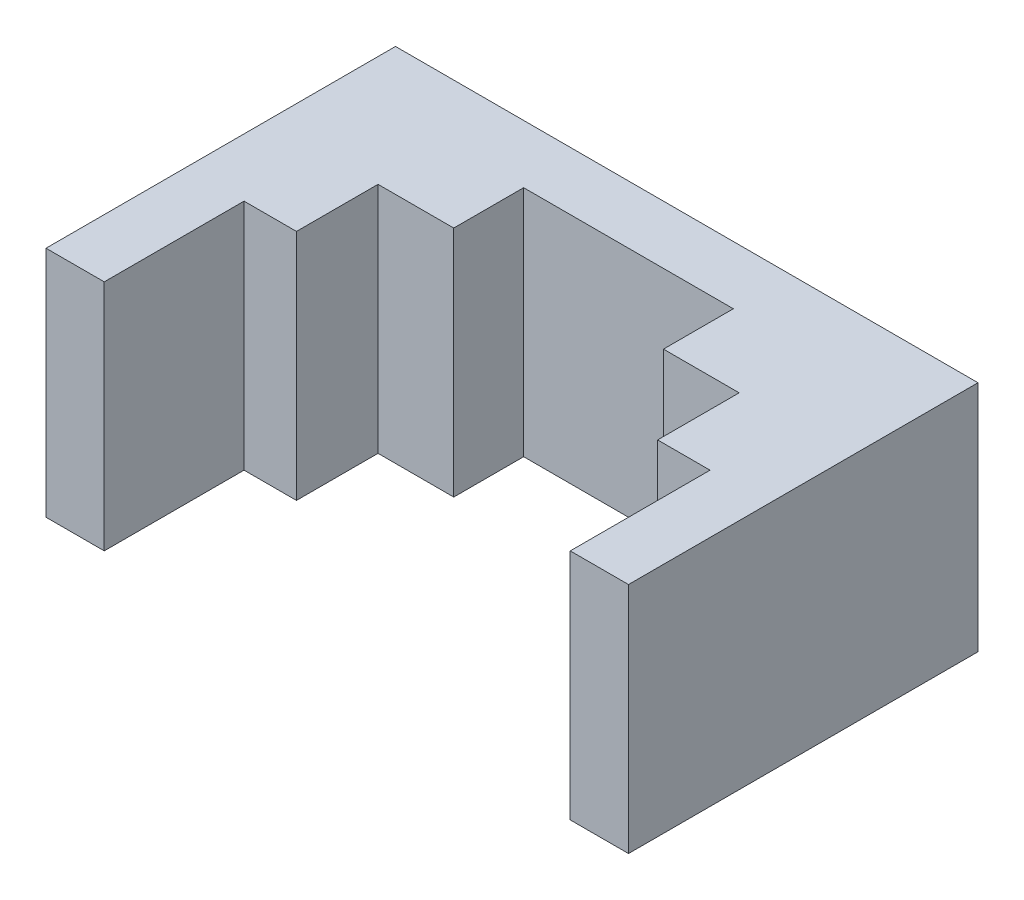
ISO-10303-21;
HEADER;
FILE_DESCRIPTION(('STEP AP214'),'2;1');
FILE_NAME('part.step','',(''),(''),'','','');
FILE_SCHEMA(('AUTOMOTIVE_DESIGN { 1 0 10303 214 1 1 1 1 }'));
ENDSEC;
DATA;
#1=APPLICATION_CONTEXT('core data for automotive mechanical design processes');
#2=APPLICATION_PROTOCOL_DEFINITION('international standard','automotive_design',2000,#1);
#3=PRODUCT_CONTEXT('',#1,'mechanical');
#4=PRODUCT('Part','Part','',(#3));
#5=PRODUCT_RELATED_PRODUCT_CATEGORY('part','',(#4));
#6=PRODUCT_DEFINITION_FORMATION('','',#4);
#7=PRODUCT_DEFINITION_CONTEXT('part definition',#1,'design');
#8=PRODUCT_DEFINITION('design','',#6,#7);
#9=PRODUCT_DEFINITION_SHAPE('','',#8);
#10=(LENGTH_UNIT() NAMED_UNIT(*) SI_UNIT(.MILLI.,.METRE.));
#11=(NAMED_UNIT(*) PLANE_ANGLE_UNIT() SI_UNIT($,.RADIAN.));
#12=(NAMED_UNIT(*) SI_UNIT($,.STERADIAN.) SOLID_ANGLE_UNIT());
#13=UNCERTAINTY_MEASURE_WITH_UNIT(LENGTH_MEASURE(1.E-05),#10,'distance_accuracy_value','');
#14=(GEOMETRIC_REPRESENTATION_CONTEXT(3) GLOBAL_UNCERTAINTY_ASSIGNED_CONTEXT((#13)) GLOBAL_UNIT_ASSIGNED_CONTEXT((#10,
#11,#12)) REPRESENTATION_CONTEXT('',''));
#15=CARTESIAN_POINT('',(0.,0.,0.));
#16=DIRECTION('',(0.,0.,1.));
#17=DIRECTION('',(1.,0.,0.));
#18=AXIS2_PLACEMENT_3D('',#15,#16,#17);
#19=CARTESIAN_POINT('',(4.5,5.,2.5));
#20=DIRECTION('',(1.,0.,0.));
#21=DIRECTION('',(0.,0.,-1.));
#22=AXIS2_PLACEMENT_3D('',#19,#20,#21);
#23=PLANE('',#22);
#24=DIRECTION('',(0.,-1.,0.));
#25=VECTOR('',#24,1.);
#26=CARTESIAN_POINT('',(4.5,5.,5.5));
#27=LINE('',#26,#25);
#28=CARTESIAN_POINT('',(4.5,5.,5.5));
#29=VERTEX_POINT('',#28);
#30=CARTESIAN_POINT('',(4.5,-5.,5.5));
#31=VERTEX_POINT('',#30);
#32=EDGE_CURVE('E177',#29,#31,#27,.T.);
#33=ORIENTED_EDGE('',*,*,#32,.F.);
#34=DIRECTION('',(0.,0.,1.));
#35=VECTOR('',#34,1.);
#36=CARTESIAN_POINT('',(4.5,5.,2.5));
#37=LINE('',#36,#35);
#38=CARTESIAN_POINT('',(4.5,5.,2.5));
#39=VERTEX_POINT('',#38);
#40=EDGE_CURVE('E167',#39,#29,#37,.T.);
#41=ORIENTED_EDGE('',*,*,#40,.F.);
#42=DIRECTION('',(0.,1.,0.));
#43=VECTOR('',#42,1.);
#44=CARTESIAN_POINT('',(4.5,5.,2.5));
#45=LINE('',#44,#43);
#46=CARTESIAN_POINT('',(4.5,-5.,2.5));
#47=VERTEX_POINT('',#46);
#48=EDGE_CURVE('E183',#47,#39,#45,.T.);
#49=ORIENTED_EDGE('',*,*,#48,.F.);
#50=DIRECTION('',(0.,0.,1.));
#51=VECTOR('',#50,1.);
#52=CARTESIAN_POINT('',(4.5,-5.,2.5));
#53=LINE('',#52,#51);
#54=EDGE_CURVE('E195',#47,#31,#53,.T.);
#55=ORIENTED_EDGE('',*,*,#54,.T.);
#56=EDGE_LOOP('',(#33,#41,#49,#55));
#57=FACE_BOUND('',#56,.T.);
#58=ADVANCED_FACE('F33',(#57),#23,.F.);
#59=CARTESIAN_POINT('',(-4.5,5.,2.5));
#60=DIRECTION('',(-1.,0.,0.));
#61=DIRECTION('',(0.,0.,1.));
#62=AXIS2_PLACEMENT_3D('',#59,#60,#61);
#63=PLANE('',#62);
#64=DIRECTION('',(0.,1.,0.));
#65=VECTOR('',#64,1.);
#66=CARTESIAN_POINT('',(-4.5,5.,5.5));
#67=LINE('',#66,#65);
#68=CARTESIAN_POINT('',(-4.5,-5.,5.5));
#69=VERTEX_POINT('',#68);
#70=CARTESIAN_POINT('',(-4.5,5.,5.5));
#71=VERTEX_POINT('',#70);
#72=EDGE_CURVE('E11',#69,#71,#67,.T.);
#73=ORIENTED_EDGE('',*,*,#72,.F.);
#74=DIRECTION('',(0.,0.,1.));
#75=VECTOR('',#74,1.);
#76=CARTESIAN_POINT('',(-4.5,-5.,2.5));
#77=LINE('',#76,#75);
#78=CARTESIAN_POINT('',(-4.5,-5.,2.5));
#79=VERTEX_POINT('',#78);
#80=EDGE_CURVE('E199',#79,#69,#77,.T.);
#81=ORIENTED_EDGE('',*,*,#80,.F.);
#82=DIRECTION('',(0.,-1.,0.));
#83=VECTOR('',#82,1.);
#84=CARTESIAN_POINT('',(-4.5,5.,2.5));
#85=LINE('',#84,#83);
#86=CARTESIAN_POINT('',(-4.5,5.,2.5));
#87=VERTEX_POINT('',#86);
#88=EDGE_CURVE('E189',#87,#79,#85,.T.);
#89=ORIENTED_EDGE('',*,*,#88,.F.);
#90=DIRECTION('',(0.,0.,1.));
#91=VECTOR('',#90,1.);
#92=CARTESIAN_POINT('',(-4.5,5.,2.5));
#93=LINE('',#92,#91);
#94=EDGE_CURVE('E202',#87,#71,#93,.T.);
#95=ORIENTED_EDGE('',*,*,#94,.T.);
#96=EDGE_LOOP('',(#73,#81,#89,#95));
#97=FACE_BOUND('',#96,.T.);
#98=ADVANCED_FACE('F301',(#97),#63,.F.);
#99=CARTESIAN_POINT('',(0.,0.,9.));
#100=DIRECTION('',(0.,0.,1.));
#101=DIRECTION('',(1.,0.,0.));
#102=AXIS2_PLACEMENT_3D('',#99,#100,#101);
#103=PLANE('',#102);
#104=DIRECTION('',(0.,1.,0.));
#105=VECTOR('',#104,1.);
#106=CARTESIAN_POINT('',(7.75,5.,9.));
#107=LINE('',#106,#105);
#108=CARTESIAN_POINT('',(7.75,-5.,9.));
#109=VERTEX_POINT('',#108);
#110=CARTESIAN_POINT('',(7.75,5.,9.));
#111=VERTEX_POINT('',#110);
#112=EDGE_CURVE('E152',#109,#111,#107,.T.);
#113=ORIENTED_EDGE('',*,*,#112,.F.);
#114=DIRECTION('',(1.,0.,0.));
#115=VECTOR('',#114,1.);
#116=CARTESIAN_POINT('',(-10.,-5.,9.));
#117=LINE('',#116,#115);
#118=CARTESIAN_POINT('',(10.,-5.,9.));
#119=VERTEX_POINT('',#118);
#120=EDGE_CURVE('E216',#109,#119,#117,.T.);
#121=ORIENTED_EDGE('',*,*,#120,.T.);
#122=DIRECTION('',(0.,1.,0.));
#123=VECTOR('',#122,1.);
#124=CARTESIAN_POINT('',(10.,5.,9.));
#125=LINE('',#124,#123);
#126=CARTESIAN_POINT('',(10.,5.,9.));
#127=VERTEX_POINT('',#126);
#128=EDGE_CURVE('E206',#119,#127,#125,.T.);
#129=ORIENTED_EDGE('',*,*,#128,.T.);
#130=DIRECTION('',(-1.,0.,0.));
#131=VECTOR('',#130,1.);
#132=CARTESIAN_POINT('',(-10.,5.,9.));
#133=LINE('',#132,#131);
#134=EDGE_CURVE('E211',#127,#111,#133,.T.);
#135=ORIENTED_EDGE('',*,*,#134,.T.);
#136=EDGE_LOOP('',(#113,#121,#129,#135));
#137=FACE_BOUND('',#136,.T.);
#138=ADVANCED_FACE('F310',(#137),#103,.T.);
#139=CARTESIAN_POINT('',(0.,0.,15.));
#140=DIRECTION('',(0.,0.,1.));
#141=DIRECTION('',(1.,0.,0.));
#142=AXIS2_PLACEMENT_3D('',#139,#140,#141);
#143=PLANE('',#142);
#144=DIRECTION('',(0.,1.,0.));
#145=VECTOR('',#144,1.);
#146=CARTESIAN_POINT('',(10.,5.,15.));
#147=LINE('',#146,#145);
#148=CARTESIAN_POINT('',(10.,-5.,15.));
#149=VERTEX_POINT('',#148);
#150=CARTESIAN_POINT('',(10.,5.,15.));
#151=VERTEX_POINT('',#150);
#152=EDGE_CURVE('E198',#149,#151,#147,.T.);
#153=ORIENTED_EDGE('',*,*,#152,.F.);
#154=DIRECTION('',(1.,0.,0.));
#155=VECTOR('',#154,1.);
#156=CARTESIAN_POINT('',(-12.5,-5.,15.));
#157=LINE('',#156,#155);
#158=CARTESIAN_POINT('',(12.5,-5.,15.));
#159=VERTEX_POINT('',#158);
#160=EDGE_CURVE('E243',#149,#159,#157,.T.);
#161=ORIENTED_EDGE('',*,*,#160,.T.);
#162=DIRECTION('',(0.,1.,0.));
#163=VECTOR('',#162,1.);
#164=CARTESIAN_POINT('',(12.5,5.,15.));
#165=LINE('',#164,#163);
#166=CARTESIAN_POINT('',(12.5,5.,15.));
#167=VERTEX_POINT('',#166);
#168=EDGE_CURVE('E233',#159,#167,#165,.T.);
#169=ORIENTED_EDGE('',*,*,#168,.T.);
#170=DIRECTION('',(-1.,0.,0.));
#171=VECTOR('',#170,1.);
#172=CARTESIAN_POINT('',(-12.5,5.,15.));
#173=LINE('',#172,#171);
#174=EDGE_CURVE('E238',#167,#151,#173,.T.);
#175=ORIENTED_EDGE('',*,*,#174,.T.);
#176=EDGE_LOOP('',(#153,#161,#169,#175));
#177=FACE_BOUND('',#176,.T.);
#178=ADVANCED_FACE('F315',(#177),#143,.T.);
#179=CARTESIAN_POINT('',(12.5,5.,15.));
#180=DIRECTION('',(-1.,0.,0.));
#181=DIRECTION('',(0.,-1.,0.));
#182=AXIS2_PLACEMENT_3D('',#179,#180,#181);
#183=PLANE('',#182);
#184=DIRECTION('',(0.,1.,0.));
#185=VECTOR('',#184,1.);
#186=CARTESIAN_POINT('',(12.5,5.,0.));
#187=LINE('',#186,#185);
#188=CARTESIAN_POINT('',(12.5,-5.,0.));
#189=VERTEX_POINT('',#188);
#190=CARTESIAN_POINT('',(12.5,5.,0.));
#191=VERTEX_POINT('',#190);
#192=EDGE_CURVE('E225',#189,#191,#187,.T.);
#193=ORIENTED_EDGE('',*,*,#192,.T.);
#194=DIRECTION('',(0.,0.,-1.));
#195=VECTOR('',#194,1.);
#196=CARTESIAN_POINT('',(12.5,5.,15.));
#197=LINE('',#196,#195);
#198=EDGE_CURVE('E41',#167,#191,#197,.T.);
#199=ORIENTED_EDGE('',*,*,#198,.F.);
#200=ORIENTED_EDGE('',*,*,#168,.F.);
#201=DIRECTION('',(0.,0.,-1.));
#202=VECTOR('',#201,1.);
#203=CARTESIAN_POINT('',(12.5,-5.,15.));
#204=LINE('',#203,#202);
#205=EDGE_CURVE('E247',#159,#189,#204,.T.);
#206=ORIENTED_EDGE('',*,*,#205,.T.);
#207=EDGE_LOOP('',(#193,#199,#200,#206));
#208=FACE_BOUND('',#207,.T.);
#209=ADVANCED_FACE('F35',(#208),#183,.F.);
#210=CARTESIAN_POINT('',(-12.5,5.,15.));
#211=DIRECTION('',(0.,-1.,0.));
#212=DIRECTION('',(0.,0.,-1.));
#213=AXIS2_PLACEMENT_3D('',#210,#211,#212);
#214=PLANE('',#213);
#215=DIRECTION('',(-1.,0.,0.));
#216=VECTOR('',#215,1.);
#217=CARTESIAN_POINT('',(-7.75,5.,5.5));
#218=LINE('',#217,#216);
#219=CARTESIAN_POINT('',(7.75,5.,5.5));
#220=VERTEX_POINT('',#219);
#221=EDGE_CURVE('E48',#220,#29,#218,.T.);
#222=ORIENTED_EDGE('',*,*,#221,.F.);
#223=DIRECTION('',(0.,0.,1.));
#224=VECTOR('',#223,1.);
#225=CARTESIAN_POINT('',(7.75,5.,5.5));
#226=LINE('',#225,#224);
#227=EDGE_CURVE('E147',#220,#111,#226,.T.);
#228=ORIENTED_EDGE('',*,*,#227,.T.);
#229=ORIENTED_EDGE('',*,*,#134,.F.);
#230=DIRECTION('',(0.,0.,1.));
#231=VECTOR('',#230,1.);
#232=CARTESIAN_POINT('',(10.,5.,9.));
#233=LINE('',#232,#231);
#234=EDGE_CURVE('E220',#127,#151,#233,.T.);
#235=ORIENTED_EDGE('',*,*,#234,.T.);
#236=ORIENTED_EDGE('',*,*,#174,.F.);
#237=ORIENTED_EDGE('',*,*,#198,.T.);
#238=DIRECTION('',(-1.,0.,0.));
#239=VECTOR('',#238,1.);
#240=CARTESIAN_POINT('',(-12.5,5.,0.));
#241=LINE('',#240,#239);
#242=CARTESIAN_POINT('',(-12.5,5.,0.));
#243=VERTEX_POINT('',#242);
#244=EDGE_CURVE('E250',#191,#243,#241,.T.);
#245=ORIENTED_EDGE('',*,*,#244,.T.);
#246=DIRECTION('',(0.,0.,-1.));
#247=VECTOR('',#246,1.);
#248=CARTESIAN_POINT('',(-12.5,5.,15.));
#249=LINE('',#248,#247);
#250=CARTESIAN_POINT('',(-12.5,5.,15.));
#251=VERTEX_POINT('',#250);
#252=EDGE_CURVE('E260',#251,#243,#249,.T.);
#253=ORIENTED_EDGE('',*,*,#252,.F.);
#254=CARTESIAN_POINT('',(-10.,5.,15.));
#255=VERTEX_POINT('',#254);
#256=EDGE_CURVE('E236',#255,#251,#173,.T.);
#257=ORIENTED_EDGE('',*,*,#256,.F.);
#258=DIRECTION('',(0.,0.,1.));
#259=VECTOR('',#258,1.);
#260=CARTESIAN_POINT('',(-10.,5.,9.));
#261=LINE('',#260,#259);
#262=CARTESIAN_POINT('',(-10.,5.,9.));
#263=VERTEX_POINT('',#262);
#264=EDGE_CURVE('E229',#263,#255,#261,.T.);
#265=ORIENTED_EDGE('',*,*,#264,.F.);
#266=CARTESIAN_POINT('',(-7.75,5.,9.));
#267=VERTEX_POINT('',#266);
#268=EDGE_CURVE('E209',#267,#263,#133,.T.);
#269=ORIENTED_EDGE('',*,*,#268,.F.);
#270=DIRECTION('',(0.,0.,1.));
#271=VECTOR('',#270,1.);
#272=CARTESIAN_POINT('',(-7.75,5.,5.5));
#273=LINE('',#272,#271);
#274=CARTESIAN_POINT('',(-7.75,5.,5.5));
#275=VERTEX_POINT('',#274);
#276=EDGE_CURVE('E156',#275,#267,#273,.T.);
#277=ORIENTED_EDGE('',*,*,#276,.F.);
#278=EDGE_CURVE('E161',#71,#275,#218,.T.);
#279=ORIENTED_EDGE('',*,*,#278,.F.);
#280=ORIENTED_EDGE('',*,*,#94,.F.);
#281=DIRECTION('',(-1.,0.,0.));
#282=VECTOR('',#281,1.);
#283=CARTESIAN_POINT('',(-4.5,5.,2.5));
#284=LINE('',#283,#282);
#285=EDGE_CURVE('E186',#39,#87,#284,.T.);
#286=ORIENTED_EDGE('',*,*,#285,.F.);
#287=ORIENTED_EDGE('',*,*,#40,.T.);
#288=EDGE_LOOP('',(#222,#228,#229,#235,#236,#237,#245,#253,#257,#265,#269,#277,#279,#280,#286,#287));
#289=FACE_BOUND('',#288,.T.);
#290=ADVANCED_FACE('F165',(#289),#214,.F.);
#291=CARTESIAN_POINT('',(-12.5,5.,15.));
#292=DIRECTION('',(1.,0.,0.));
#293=DIRECTION('',(0.,1.,0.));
#294=AXIS2_PLACEMENT_3D('',#291,#292,#293);
#295=PLANE('',#294);
#296=DIRECTION('',(0.,-1.,0.));
#297=VECTOR('',#296,1.);
#298=CARTESIAN_POINT('',(-12.5,5.,0.));
#299=LINE('',#298,#297);
#300=CARTESIAN_POINT('',(-12.5,-5.,0.));
#301=VERTEX_POINT('',#300);
#302=EDGE_CURVE('E252',#243,#301,#299,.T.);
#303=ORIENTED_EDGE('',*,*,#302,.T.);
#304=DIRECTION('',(0.,0.,-1.));
#305=VECTOR('',#304,1.);
#306=CARTESIAN_POINT('',(-12.5,-5.,15.));
#307=LINE('',#306,#305);
#308=CARTESIAN_POINT('',(-12.5,-5.,15.));
#309=VERTEX_POINT('',#308);
#310=EDGE_CURVE('E257',#309,#301,#307,.T.);
#311=ORIENTED_EDGE('',*,*,#310,.F.);
#312=DIRECTION('',(0.,-1.,0.));
#313=VECTOR('',#312,1.);
#314=CARTESIAN_POINT('',(-12.5,5.,15.));
#315=LINE('',#314,#313);
#316=EDGE_CURVE('E241',#251,#309,#315,.T.);
#317=ORIENTED_EDGE('',*,*,#316,.F.);
#318=ORIENTED_EDGE('',*,*,#252,.T.);
#319=EDGE_LOOP('',(#303,#311,#317,#318));
#320=FACE_BOUND('',#319,.T.);
#321=ADVANCED_FACE('F275',(#320),#295,.F.);
#322=CARTESIAN_POINT('',(-12.5,-5.,15.));
#323=DIRECTION('',(0.,1.,0.));
#324=DIRECTION('',(0.,0.,1.));
#325=AXIS2_PLACEMENT_3D('',#322,#323,#324);
#326=PLANE('',#325);
#327=DIRECTION('',(1.,0.,0.));
#328=VECTOR('',#327,1.);
#329=CARTESIAN_POINT('',(-7.75,-5.,5.5));
#330=LINE('',#329,#328);
#331=CARTESIAN_POINT('',(-7.75,-5.,5.5));
#332=VERTEX_POINT('',#331);
#333=EDGE_CURVE('E55',#332,#69,#330,.T.);
#334=ORIENTED_EDGE('',*,*,#333,.F.);
#335=DIRECTION('',(0.,0.,1.));
#336=VECTOR('',#335,1.);
#337=CARTESIAN_POINT('',(-7.75,-5.,5.5));
#338=LINE('',#337,#336);
#339=CARTESIAN_POINT('',(-7.75,-5.,9.));
#340=VERTEX_POINT('',#339);
#341=EDGE_CURVE('E178',#332,#340,#338,.T.);
#342=ORIENTED_EDGE('',*,*,#341,.T.);
#343=CARTESIAN_POINT('',(-10.,-5.,9.));
#344=VERTEX_POINT('',#343);
#345=EDGE_CURVE('E217',#344,#340,#117,.T.);
#346=ORIENTED_EDGE('',*,*,#345,.F.);
#347=DIRECTION('',(0.,0.,1.));
#348=VECTOR('',#347,1.);
#349=CARTESIAN_POINT('',(-10.,-5.,9.));
#350=LINE('',#349,#348);
#351=CARTESIAN_POINT('',(-10.,-5.,15.));
#352=VERTEX_POINT('',#351);
#353=EDGE_CURVE('E226',#344,#352,#350,.T.);
#354=ORIENTED_EDGE('',*,*,#353,.T.);
#355=EDGE_CURVE('E244',#309,#352,#157,.T.);
#356=ORIENTED_EDGE('',*,*,#355,.F.);
#357=ORIENTED_EDGE('',*,*,#310,.T.);
#358=DIRECTION('',(1.,0.,0.));
#359=VECTOR('',#358,1.);
#360=CARTESIAN_POINT('',(-12.5,-5.,0.));
#361=LINE('',#360,#359);
#362=EDGE_CURVE('E237',#301,#189,#361,.T.);
#363=ORIENTED_EDGE('',*,*,#362,.T.);
#364=ORIENTED_EDGE('',*,*,#205,.F.);
#365=ORIENTED_EDGE('',*,*,#160,.F.);
#366=DIRECTION('',(0.,0.,1.));
#367=VECTOR('',#366,1.);
#368=CARTESIAN_POINT('',(10.,-5.,9.));
#369=LINE('',#368,#367);
#370=EDGE_CURVE('E223',#119,#149,#369,.T.);
#371=ORIENTED_EDGE('',*,*,#370,.F.);
#372=ORIENTED_EDGE('',*,*,#120,.F.);
#373=DIRECTION('',(0.,0.,1.));
#374=VECTOR('',#373,1.);
#375=CARTESIAN_POINT('',(7.75,-5.,5.5));
#376=LINE('',#375,#374);
#377=CARTESIAN_POINT('',(7.75,-5.,5.5));
#378=VERTEX_POINT('',#377);
#379=EDGE_CURVE('E175',#378,#109,#376,.T.);
#380=ORIENTED_EDGE('',*,*,#379,.F.);
#381=EDGE_CURVE('E160',#31,#378,#330,.T.);
#382=ORIENTED_EDGE('',*,*,#381,.F.);
#383=ORIENTED_EDGE('',*,*,#54,.F.);
#384=DIRECTION('',(1.,0.,0.));
#385=VECTOR('',#384,1.);
#386=CARTESIAN_POINT('',(-4.5,-5.,2.5));
#387=LINE('',#386,#385);
#388=EDGE_CURVE('E192',#79,#47,#387,.T.);
#389=ORIENTED_EDGE('',*,*,#388,.F.);
#390=ORIENTED_EDGE('',*,*,#80,.T.);
#391=EDGE_LOOP('',(#334,#342,#346,#354,#356,#357,#363,#364,#365,#371,#372,#380,#382,#383,#389,#390));
#392=FACE_BOUND('',#391,.T.);
#393=ADVANCED_FACE('F279',(#392),#326,.F.);
#394=DIRECTION('',(0.,-1.,0.));
#395=VECTOR('',#394,1.);
#396=CARTESIAN_POINT('',(-10.,5.,15.));
#397=LINE('',#396,#395);
#398=EDGE_CURVE('E210',#255,#352,#397,.T.);
#399=ORIENTED_EDGE('',*,*,#398,.F.);
#400=ORIENTED_EDGE('',*,*,#256,.T.);
#401=ORIENTED_EDGE('',*,*,#316,.T.);
#402=ORIENTED_EDGE('',*,*,#355,.T.);
#403=EDGE_LOOP('',(#399,#400,#401,#402));
#404=FACE_BOUND('',#403,.T.);
#405=ADVANCED_FACE('F283',(#404),#143,.T.);
#406=CARTESIAN_POINT('',(0.,0.,0.));
#407=DIRECTION('',(0.,0.,1.));
#408=DIRECTION('',(1.,0.,0.));
#409=AXIS2_PLACEMENT_3D('',#406,#407,#408);
#410=PLANE('',#409);
#411=ORIENTED_EDGE('',*,*,#192,.F.);
#412=ORIENTED_EDGE('',*,*,#362,.F.);
#413=ORIENTED_EDGE('',*,*,#302,.F.);
#414=ORIENTED_EDGE('',*,*,#244,.F.);
#415=EDGE_LOOP('',(#411,#412,#413,#414));
#416=FACE_BOUND('',#415,.T.);
#417=ADVANCED_FACE('F271',(#416),#410,.F.);
#418=CARTESIAN_POINT('',(10.,5.,9.));
#419=DIRECTION('',(1.,0.,0.));
#420=DIRECTION('',(0.,0.,-1.));
#421=AXIS2_PLACEMENT_3D('',#418,#419,#420);
#422=PLANE('',#421);
#423=ORIENTED_EDGE('',*,*,#152,.T.);
#424=ORIENTED_EDGE('',*,*,#234,.F.);
#425=ORIENTED_EDGE('',*,*,#128,.F.);
#426=ORIENTED_EDGE('',*,*,#370,.T.);
#427=EDGE_LOOP('',(#423,#424,#425,#426));
#428=FACE_BOUND('',#427,.T.);
#429=ADVANCED_FACE('F317',(#428),#422,.F.);
#430=CARTESIAN_POINT('',(-10.,5.,9.));
#431=DIRECTION('',(-1.,0.,0.));
#432=DIRECTION('',(0.,0.,1.));
#433=AXIS2_PLACEMENT_3D('',#430,#431,#432);
#434=PLANE('',#433);
#435=ORIENTED_EDGE('',*,*,#398,.T.);
#436=ORIENTED_EDGE('',*,*,#353,.F.);
#437=DIRECTION('',(0.,-1.,0.));
#438=VECTOR('',#437,1.);
#439=CARTESIAN_POINT('',(-10.,5.,9.));
#440=LINE('',#439,#438);
#441=EDGE_CURVE('E213',#263,#344,#440,.T.);
#442=ORIENTED_EDGE('',*,*,#441,.F.);
#443=ORIENTED_EDGE('',*,*,#264,.T.);
#444=EDGE_LOOP('',(#435,#436,#442,#443));
#445=FACE_BOUND('',#444,.T.);
#446=ADVANCED_FACE('F290',(#445),#434,.F.);
#447=DIRECTION('',(0.,-1.,0.));
#448=VECTOR('',#447,1.);
#449=CARTESIAN_POINT('',(-7.75,5.,9.));
#450=LINE('',#449,#448);
#451=EDGE_CURVE('E162',#267,#340,#450,.T.);
#452=ORIENTED_EDGE('',*,*,#451,.F.);
#453=ORIENTED_EDGE('',*,*,#268,.T.);
#454=ORIENTED_EDGE('',*,*,#441,.T.);
#455=ORIENTED_EDGE('',*,*,#345,.T.);
#456=EDGE_LOOP('',(#452,#453,#454,#455));
#457=FACE_BOUND('',#456,.T.);
#458=ADVANCED_FACE('F293',(#457),#103,.T.);
#459=CARTESIAN_POINT('',(0.,0.,2.5));
#460=DIRECTION('',(0.,0.,1.));
#461=DIRECTION('',(1.,0.,0.));
#462=AXIS2_PLACEMENT_3D('',#459,#460,#461);
#463=PLANE('',#462);
#464=ORIENTED_EDGE('',*,*,#48,.T.);
#465=ORIENTED_EDGE('',*,*,#285,.T.);
#466=ORIENTED_EDGE('',*,*,#88,.T.);
#467=ORIENTED_EDGE('',*,*,#388,.T.);
#468=EDGE_LOOP('',(#464,#465,#466,#467));
#469=FACE_BOUND('',#468,.T.);
#470=ADVANCED_FACE('F304',(#469),#463,.T.);
#471=CARTESIAN_POINT('',(0.,0.,5.5));
#472=DIRECTION('',(0.,0.,1.));
#473=DIRECTION('',(1.,0.,0.));
#474=AXIS2_PLACEMENT_3D('',#471,#472,#473);
#475=PLANE('',#474);
#476=ORIENTED_EDGE('',*,*,#72,.T.);
#477=ORIENTED_EDGE('',*,*,#278,.T.);
#478=DIRECTION('',(0.,-1.,0.));
#479=VECTOR('',#478,1.);
#480=CARTESIAN_POINT('',(-7.75,5.,5.5));
#481=LINE('',#480,#479);
#482=EDGE_CURVE('E168',#275,#332,#481,.T.);
#483=ORIENTED_EDGE('',*,*,#482,.T.);
#484=ORIENTED_EDGE('',*,*,#333,.T.);
#485=EDGE_LOOP('',(#476,#477,#483,#484));
#486=FACE_BOUND('',#485,.T.);
#487=ADVANCED_FACE('F297',(#486),#475,.T.);
#488=CARTESIAN_POINT('',(-7.75,5.,5.5));
#489=DIRECTION('',(-1.,0.,0.));
#490=DIRECTION('',(0.,0.,1.));
#491=AXIS2_PLACEMENT_3D('',#488,#489,#490);
#492=PLANE('',#491);
#493=ORIENTED_EDGE('',*,*,#451,.T.);
#494=ORIENTED_EDGE('',*,*,#341,.F.);
#495=ORIENTED_EDGE('',*,*,#482,.F.);
#496=ORIENTED_EDGE('',*,*,#276,.T.);
#497=EDGE_LOOP('',(#493,#494,#495,#496));
#498=FACE_BOUND('',#497,.T.);
#499=ADVANCED_FACE('F296',(#498),#492,.F.);
#500=ORIENTED_EDGE('',*,*,#32,.T.);
#501=ORIENTED_EDGE('',*,*,#381,.T.);
#502=DIRECTION('',(0.,1.,0.));
#503=VECTOR('',#502,1.);
#504=CARTESIAN_POINT('',(7.75,5.,5.5));
#505=LINE('',#504,#503);
#506=EDGE_CURVE('E149',#378,#220,#505,.T.);
#507=ORIENTED_EDGE('',*,*,#506,.T.);
#508=ORIENTED_EDGE('',*,*,#221,.T.);
#509=EDGE_LOOP('',(#500,#501,#507,#508));
#510=FACE_BOUND('',#509,.T.);
#511=ADVANCED_FACE('F158',(#510),#475,.T.);
#512=CARTESIAN_POINT('',(7.75,5.,5.5));
#513=DIRECTION('',(1.,0.,0.));
#514=DIRECTION('',(0.,0.,-1.));
#515=AXIS2_PLACEMENT_3D('',#512,#513,#514);
#516=PLANE('',#515);
#517=ORIENTED_EDGE('',*,*,#112,.T.);
#518=ORIENTED_EDGE('',*,*,#227,.F.);
#519=ORIENTED_EDGE('',*,*,#506,.F.);
#520=ORIENTED_EDGE('',*,*,#379,.T.);
#521=EDGE_LOOP('',(#517,#518,#519,#520));
#522=FACE_BOUND('',#521,.T.);
#523=ADVANCED_FACE('F148',(#522),#516,.F.);
#524=CLOSED_SHELL('',(#58,#98,#138,#178,#209,#290,#321,#393,#405,#417,#429,#446,#458,#470,#487,
#499,#511,#523));
#525=MANIFOLD_SOLID_BREP('B2',#524);
#526=ADVANCED_BREP_SHAPE_REPRESENTATION('',(#18,#525),#14);
#527=SHAPE_DEFINITION_REPRESENTATION(#9,#526);
ENDSEC;
END-ISO-10303-21;
